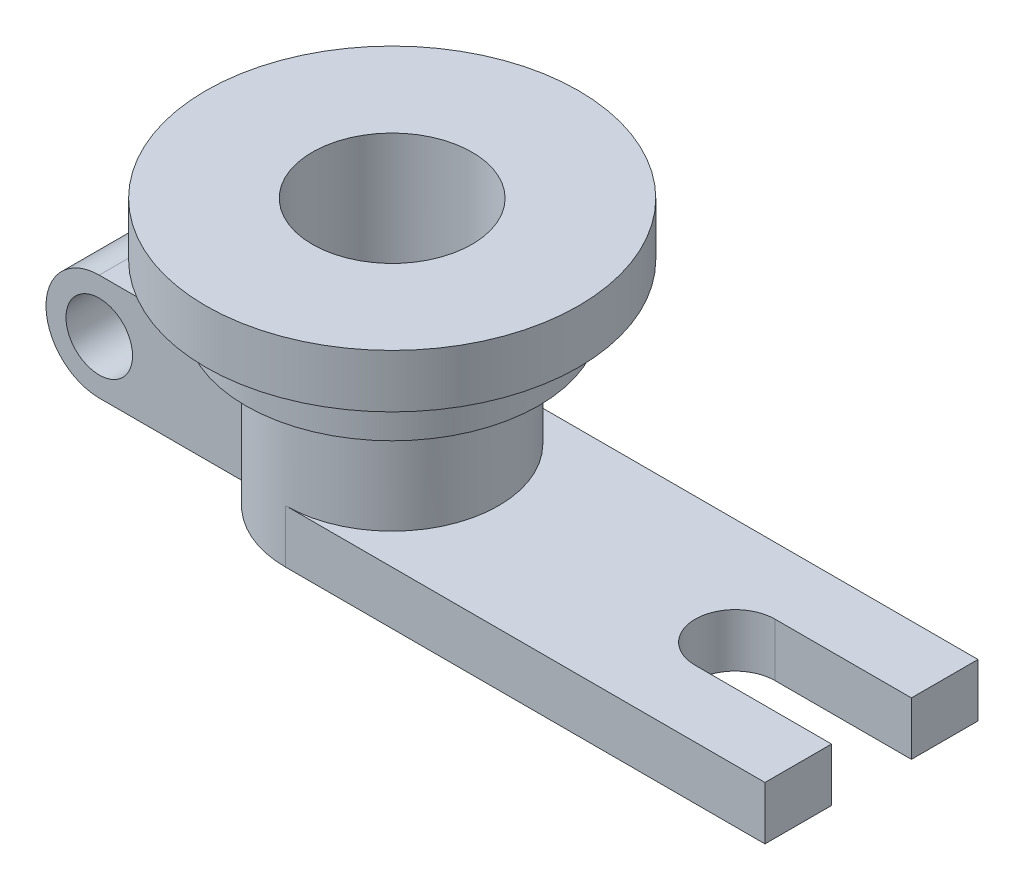
ISO-10303-21;
HEADER;
FILE_DESCRIPTION(('STEP AP214'),'2;1');
FILE_NAME('part.step','',(''),(''),'','','');
FILE_SCHEMA(('AUTOMOTIVE_DESIGN { 1 0 10303 214 1 1 1 1 }'));
ENDSEC;
DATA;
#1=APPLICATION_CONTEXT('core data for automotive mechanical design processes');
#2=APPLICATION_PROTOCOL_DEFINITION('international standard','automotive_design',2000,#1);
#3=PRODUCT_CONTEXT('',#1,'mechanical');
#4=PRODUCT('Part','Part','',(#3));
#5=PRODUCT_RELATED_PRODUCT_CATEGORY('part','',(#4));
#6=PRODUCT_DEFINITION_FORMATION('','',#4);
#7=PRODUCT_DEFINITION_CONTEXT('part definition',#1,'design');
#8=PRODUCT_DEFINITION('design','',#6,#7);
#9=PRODUCT_DEFINITION_SHAPE('','',#8);
#10=(LENGTH_UNIT() NAMED_UNIT(*) SI_UNIT(.MILLI.,.METRE.));
#11=(NAMED_UNIT(*) PLANE_ANGLE_UNIT() SI_UNIT($,.RADIAN.));
#12=(NAMED_UNIT(*) SI_UNIT($,.STERADIAN.) SOLID_ANGLE_UNIT());
#13=UNCERTAINTY_MEASURE_WITH_UNIT(LENGTH_MEASURE(1.E-05),#10,'distance_accuracy_value','');
#14=(GEOMETRIC_REPRESENTATION_CONTEXT(3) GLOBAL_UNCERTAINTY_ASSIGNED_CONTEXT((#13)) GLOBAL_UNIT_ASSIGNED_CONTEXT((#10,
#11,#12)) REPRESENTATION_CONTEXT('',''));
#15=CARTESIAN_POINT('',(0.,0.,0.));
#16=DIRECTION('',(0.,0.,1.));
#17=DIRECTION('',(1.,0.,0.));
#18=AXIS2_PLACEMENT_3D('',#15,#16,#17);
#19=CARTESIAN_POINT('',(180.001,-20.,20.));
#20=DIRECTION('',(0.,0.,-1.));
#21=DIRECTION('',(-1.,0.,0.));
#22=AXIS2_PLACEMENT_3D('',#19,#20,#21);
#23=PLANE('',#22);
#24=CARTESIAN_POINT('',(-90.,-40.,20.));
#25=DIRECTION('',(0.,0.,1.));
#26=DIRECTION('',(1.,0.,0.));
#27=AXIS2_PLACEMENT_3D('',#24,#25,#26);
#28=CIRCLE('',#27,12.5);
#29=CARTESIAN_POINT('',(-77.5,-40.,20.));
#30=VERTEX_POINT('',#29);
#31=EDGE_CURVE('E456',#30,#30,#28,.T.);
#32=ORIENTED_EDGE('',*,*,#31,.F.);
#33=EDGE_LOOP('',(#32));
#34=FACE_BOUND('',#33,.T.);
#35=DIRECTION('',(-1.,0.,0.));
#36=VECTOR('',#35,1.);
#37=CARTESIAN_POINT('',(180.001,-20.,20.));
#38=LINE('',#37,#36);
#39=CARTESIAN_POINT('',(-34.6410161513776,-20.,20.));
#40=VERTEX_POINT('',#39);
#41=CARTESIAN_POINT('',(-90.,-20.,20.));
#42=VERTEX_POINT('',#41);
#43=EDGE_CURVE('E138',#40,#42,#38,.T.);
#44=ORIENTED_EDGE('',*,*,#43,.T.);
#45=CARTESIAN_POINT('',(-90.,-40.,20.));
#46=DIRECTION('',(0.,0.,1.));
#47=DIRECTION('',(1.,0.,0.));
#48=AXIS2_PLACEMENT_3D('',#45,#46,#47);
#49=CIRCLE('',#48,20.);
#50=CARTESIAN_POINT('',(-90.,-60.,20.));
#51=VERTEX_POINT('',#50);
#52=EDGE_CURVE('E127',#42,#51,#49,.T.);
#53=ORIENTED_EDGE('',*,*,#52,.T.);
#54=DIRECTION('',(-1.,0.,0.));
#55=VECTOR('',#54,1.);
#56=CARTESIAN_POINT('',(180.001,-60.,20.));
#57=LINE('',#56,#55);
#58=CARTESIAN_POINT('',(-34.6410161513776,-60.,20.));
#59=VERTEX_POINT('',#58);
#60=EDGE_CURVE('E144',#59,#51,#57,.T.);
#61=ORIENTED_EDGE('',*,*,#60,.F.);
#62=DIRECTION('',(0.,1.,0.));
#63=VECTOR('',#62,1.);
#64=CARTESIAN_POINT('',(-34.6410161513776,-60.,20.));
#65=LINE('',#64,#63);
#66=EDGE_CURVE('E142',#40,#59,#65,.F.);
#67=ORIENTED_EDGE('',*,*,#66,.F.);
#68=EDGE_LOOP('',(#44,#53,#61,#67));
#69=FACE_BOUND('',#68,.T.);
#70=ADVANCED_FACE('F35',(#34,#69),#23,.F.);
#71=CARTESIAN_POINT('',(180.001,-20.,-20.));
#72=DIRECTION('',(0.,0.,1.));
#73=DIRECTION('',(0.,-1.,0.));
#74=AXIS2_PLACEMENT_3D('',#71,#72,#73);
#75=PLANE('',#74);
#76=CARTESIAN_POINT('',(-90.,-40.,-20.));
#77=DIRECTION('',(0.,0.,1.));
#78=DIRECTION('',(0.,-1.,0.));
#79=AXIS2_PLACEMENT_3D('',#76,#77,#78);
#80=CIRCLE('',#79,12.5);
#81=CARTESIAN_POINT('',(-90.,-52.5,-20.));
#82=VERTEX_POINT('',#81);
#83=EDGE_CURVE('E39',#82,#82,#80,.T.);
#84=ORIENTED_EDGE('',*,*,#83,.T.);
#85=EDGE_LOOP('',(#84));
#86=FACE_BOUND('',#85,.T.);
#87=CARTESIAN_POINT('',(-90.,-40.,-20.));
#88=DIRECTION('',(0.,0.,1.));
#89=DIRECTION('',(0.,-1.,0.));
#90=AXIS2_PLACEMENT_3D('',#87,#88,#89);
#91=CIRCLE('',#90,20.);
#92=CARTESIAN_POINT('',(-90.,-20.,-20.));
#93=VERTEX_POINT('',#92);
#94=CARTESIAN_POINT('',(-90.,-60.,-20.));
#95=VERTEX_POINT('',#94);
#96=EDGE_CURVE('E145',#93,#95,#91,.T.);
#97=ORIENTED_EDGE('',*,*,#96,.F.);
#98=DIRECTION('',(-1.,0.,0.));
#99=VECTOR('',#98,1.);
#100=CARTESIAN_POINT('',(180.001,-20.,-20.));
#101=LINE('',#100,#99);
#102=CARTESIAN_POINT('',(-34.6410161513775,-20.,-20.));
#103=VERTEX_POINT('',#102);
#104=EDGE_CURVE('E140',#103,#93,#101,.T.);
#105=ORIENTED_EDGE('',*,*,#104,.F.);
#106=DIRECTION('',(0.,1.,0.));
#107=VECTOR('',#106,1.);
#108=CARTESIAN_POINT('',(-34.6410161513775,-60.,-20.));
#109=LINE('',#108,#107);
#110=CARTESIAN_POINT('',(-34.6410161513775,-60.,-20.));
#111=VERTEX_POINT('',#110);
#112=EDGE_CURVE('E151',#111,#103,#109,.T.);
#113=ORIENTED_EDGE('',*,*,#112,.F.);
#114=DIRECTION('',(-1.,0.,0.));
#115=VECTOR('',#114,1.);
#116=CARTESIAN_POINT('',(180.001,-60.,-20.));
#117=LINE('',#116,#115);
#118=EDGE_CURVE('E51',#111,#95,#117,.T.);
#119=ORIENTED_EDGE('',*,*,#118,.T.);
#120=EDGE_LOOP('',(#97,#105,#113,#119));
#121=FACE_BOUND('',#120,.T.);
#122=ADVANCED_FACE('F256',(#86,#121),#75,.F.);
#123=CARTESIAN_POINT('',(0.,-60.,0.));
#124=DIRECTION('',(0.,1.,0.));
#125=DIRECTION('',(0.,0.,1.));
#126=AXIS2_PLACEMENT_3D('',#123,#124,#125);
#127=CYLINDRICAL_SURFACE('',#126,40.);
#128=CARTESIAN_POINT('',(0.,0.,0.));
#129=DIRECTION('',(0.,1.,0.));
#130=DIRECTION('',(0.,0.,1.));
#131=AXIS2_PLACEMENT_3D('',#128,#129,#130);
#132=CIRCLE('',#131,40.);
#133=CARTESIAN_POINT('',(0.,0.,40.));
#134=VERTEX_POINT('',#133);
#135=EDGE_CURVE('E44',#134,#134,#132,.F.);
#136=ORIENTED_EDGE('',*,*,#135,.T.);
#137=EDGE_LOOP('',(#136));
#138=FACE_BOUND('',#137,.T.);
#139=ORIENTED_EDGE('',*,*,#66,.T.);
#140=CARTESIAN_POINT('',(0.,-60.,0.));
#141=DIRECTION('',(0.,-1.,0.));
#142=DIRECTION('',(0.,0.,-1.));
#143=AXIS2_PLACEMENT_3D('',#140,#141,#142);
#144=CIRCLE('',#143,40.);
#145=CARTESIAN_POINT('',(0.,-60.,40.));
#146=VERTEX_POINT('',#145);
#147=EDGE_CURVE('E218',#146,#59,#144,.T.);
#148=ORIENTED_EDGE('',*,*,#147,.F.);
#149=DIRECTION('',(0.,1.,0.));
#150=VECTOR('',#149,1.);
#151=CARTESIAN_POINT('',(0.,-60.,40.));
#152=LINE('',#151,#150);
#153=CARTESIAN_POINT('',(0.,-40.,40.));
#154=VERTEX_POINT('',#153);
#155=EDGE_CURVE('E180',#154,#146,#152,.F.);
#156=ORIENTED_EDGE('',*,*,#155,.F.);
#157=CARTESIAN_POINT('',(0.,-40.,0.));
#158=DIRECTION('',(0.,1.,0.));
#159=DIRECTION('',(0.,0.,1.));
#160=AXIS2_PLACEMENT_3D('',#157,#158,#159);
#161=CIRCLE('',#160,40.);
#162=CARTESIAN_POINT('',(0.,-40.,-40.));
#163=VERTEX_POINT('',#162);
#164=EDGE_CURVE('E183',#163,#154,#161,.F.);
#165=ORIENTED_EDGE('',*,*,#164,.F.);
#166=DIRECTION('',(0.,1.,0.));
#167=VECTOR('',#166,1.);
#168=CARTESIAN_POINT('',(0.,-60.,-40.));
#169=LINE('',#168,#167);
#170=CARTESIAN_POINT('',(0.,-60.,-40.));
#171=VERTEX_POINT('',#170);
#172=EDGE_CURVE('E182',#163,#171,#169,.F.);
#173=ORIENTED_EDGE('',*,*,#172,.T.);
#174=EDGE_CURVE('E215',#111,#171,#144,.T.);
#175=ORIENTED_EDGE('',*,*,#174,.F.);
#176=ORIENTED_EDGE('',*,*,#112,.T.);
#177=CARTESIAN_POINT('',(0.,-20.,0.));
#178=DIRECTION('',(0.,-1.,0.));
#179=DIRECTION('',(0.,0.,-1.));
#180=AXIS2_PLACEMENT_3D('',#177,#178,#179);
#181=CIRCLE('',#180,40.);
#182=EDGE_CURVE('E155',#103,#40,#181,.F.);
#183=ORIENTED_EDGE('',*,*,#182,.T.);
#184=EDGE_LOOP('',(#139,#148,#156,#165,#173,#175,#176,#183));
#185=FACE_BOUND('',#184,.T.);
#186=ADVANCED_FACE('F236',(#138,#185),#127,.T.);
#187=CARTESIAN_POINT('',(180.,0.,0.));
#188=DIRECTION('',(1.,0.,0.));
#189=DIRECTION('',(0.,0.,-1.));
#190=AXIS2_PLACEMENT_3D('',#187,#188,#189);
#191=PLANE('',#190);
#192=DIRECTION('',(0.,1.,0.));
#193=VECTOR('',#192,1.);
#194=CARTESIAN_POINT('',(180.,-100.,-15.0000000000001));
#195=LINE('',#194,#193);
#196=CARTESIAN_POINT('',(180.,-60.,-15.0000000000001));
#197=VERTEX_POINT('',#196);
#198=CARTESIAN_POINT('',(180.,-40.,-15.));
#199=VERTEX_POINT('',#198);
#200=EDGE_CURVE('E168',#197,#199,#195,.T.);
#201=ORIENTED_EDGE('',*,*,#200,.F.);
#202=DIRECTION('',(0.,0.,-1.));
#203=VECTOR('',#202,1.);
#204=CARTESIAN_POINT('',(180.,-60.,40.));
#205=LINE('',#204,#203);
#206=CARTESIAN_POINT('',(180.,-60.,-40.));
#207=VERTEX_POINT('',#206);
#208=EDGE_CURVE('E196',#197,#207,#205,.T.);
#209=ORIENTED_EDGE('',*,*,#208,.T.);
#210=DIRECTION('',(0.,1.,0.));
#211=VECTOR('',#210,1.);
#212=CARTESIAN_POINT('',(180.,-40.,-40.));
#213=LINE('',#212,#211);
#214=CARTESIAN_POINT('',(180.,-40.,-40.));
#215=VERTEX_POINT('',#214);
#216=EDGE_CURVE('E179',#207,#215,#213,.T.);
#217=ORIENTED_EDGE('',*,*,#216,.T.);
#218=DIRECTION('',(0.,0.,1.));
#219=VECTOR('',#218,1.);
#220=CARTESIAN_POINT('',(180.,-40.,40.));
#221=LINE('',#220,#219);
#222=EDGE_CURVE('E190',#215,#199,#221,.T.);
#223=ORIENTED_EDGE('',*,*,#222,.T.);
#224=EDGE_LOOP('',(#201,#209,#217,#223));
#225=FACE_BOUND('',#224,.T.);
#226=ADVANCED_FACE('F246',(#225),#191,.T.);
#227=CARTESIAN_POINT('',(0.,20.,0.));
#228=DIRECTION('',(0.,-1.,0.));
#229=DIRECTION('',(0.,0.,-1.));
#230=AXIS2_PLACEMENT_3D('',#227,#228,#229);
#231=CYLINDRICAL_SURFACE('',#230,55.);
#232=CARTESIAN_POINT('',(0.,20.,0.));
#233=DIRECTION('',(0.,1.,0.));
#234=DIRECTION('',(0.,0.,1.));
#235=AXIS2_PLACEMENT_3D('',#232,#233,#234);
#236=CIRCLE('',#235,55.);
#237=CARTESIAN_POINT('',(0.,20.,55.));
#238=VERTEX_POINT('',#237);
#239=EDGE_CURVE('E228',#238,#238,#236,.T.);
#240=ORIENTED_EDGE('',*,*,#239,.F.);
#241=EDGE_LOOP('',(#240));
#242=FACE_BOUND('',#241,.T.);
#243=CARTESIAN_POINT('',(0.,0.,0.));
#244=DIRECTION('',(0.,1.,0.));
#245=DIRECTION('',(0.,0.,1.));
#246=AXIS2_PLACEMENT_3D('',#243,#244,#245);
#247=CIRCLE('',#246,55.);
#248=CARTESIAN_POINT('',(0.,0.,55.));
#249=VERTEX_POINT('',#248);
#250=EDGE_CURVE('E225',#249,#249,#247,.T.);
#251=ORIENTED_EDGE('',*,*,#250,.T.);
#252=EDGE_LOOP('',(#251));
#253=FACE_BOUND('',#252,.T.);
#254=ADVANCED_FACE('F37',(#242,#253),#231,.T.);
#255=CARTESIAN_POINT('',(0.,0.,0.));
#256=DIRECTION('',(0.,1.,0.));
#257=DIRECTION('',(0.,0.,1.));
#258=AXIS2_PLACEMENT_3D('',#255,#256,#257);
#259=PLANE('',#258);
#260=ORIENTED_EDGE('',*,*,#135,.F.);
#261=EDGE_LOOP('',(#260));
#262=FACE_BOUND('',#261,.T.);
#263=ORIENTED_EDGE('',*,*,#250,.F.);
#264=EDGE_LOOP('',(#263));
#265=FACE_BOUND('',#264,.T.);
#266=ADVANCED_FACE('F239',(#262,#265),#259,.F.);
#267=CARTESIAN_POINT('',(0.,40.,0.));
#268=DIRECTION('',(0.,-1.,0.));
#269=DIRECTION('',(0.,0.,-1.));
#270=AXIS2_PLACEMENT_3D('',#267,#268,#269);
#271=CYLINDRICAL_SURFACE('',#270,70.);
#272=CARTESIAN_POINT('',(0.,40.,0.));
#273=DIRECTION('',(0.,1.,0.));
#274=DIRECTION('',(0.,0.,1.));
#275=AXIS2_PLACEMENT_3D('',#272,#273,#274);
#276=CIRCLE('',#275,70.);
#277=CARTESIAN_POINT('',(0.,40.,70.));
#278=VERTEX_POINT('',#277);
#279=EDGE_CURVE('E222',#278,#278,#276,.T.);
#280=ORIENTED_EDGE('',*,*,#279,.F.);
#281=EDGE_LOOP('',(#280));
#282=FACE_BOUND('',#281,.T.);
#283=CARTESIAN_POINT('',(0.,20.,0.));
#284=DIRECTION('',(0.,1.,0.));
#285=DIRECTION('',(0.,0.,1.));
#286=AXIS2_PLACEMENT_3D('',#283,#284,#285);
#287=CIRCLE('',#286,70.);
#288=CARTESIAN_POINT('',(0.,20.,70.));
#289=VERTEX_POINT('',#288);
#290=EDGE_CURVE('E221',#289,#289,#287,.T.);
#291=ORIENTED_EDGE('',*,*,#290,.T.);
#292=EDGE_LOOP('',(#291));
#293=FACE_BOUND('',#292,.T.);
#294=ADVANCED_FACE('F242',(#282,#293),#271,.T.);
#295=CARTESIAN_POINT('',(0.,40.,0.));
#296=DIRECTION('',(0.,1.,0.));
#297=DIRECTION('',(0.,0.,1.));
#298=AXIS2_PLACEMENT_3D('',#295,#296,#297);
#299=PLANE('',#298);
#300=CARTESIAN_POINT('',(0.,40.,0.));
#301=DIRECTION('',(0.,1.,0.));
#302=DIRECTION('',(0.,0.,1.));
#303=AXIS2_PLACEMENT_3D('',#300,#301,#302);
#304=CIRCLE('',#303,30.);
#305=CARTESIAN_POINT('',(0.,40.,30.));
#306=VERTEX_POINT('',#305);
#307=EDGE_CURVE('E212',#306,#306,#304,.T.);
#308=ORIENTED_EDGE('',*,*,#307,.F.);
#309=EDGE_LOOP('',(#308));
#310=FACE_BOUND('',#309,.T.);
#311=ORIENTED_EDGE('',*,*,#279,.T.);
#312=EDGE_LOOP('',(#311));
#313=FACE_BOUND('',#312,.T.);
#314=ADVANCED_FACE('F302',(#310,#313),#299,.T.);
#315=CARTESIAN_POINT('',(0.,20.,0.));
#316=DIRECTION('',(0.,1.,0.));
#317=DIRECTION('',(0.,0.,1.));
#318=AXIS2_PLACEMENT_3D('',#315,#316,#317);
#319=PLANE('',#318);
#320=ORIENTED_EDGE('',*,*,#239,.T.);
#321=EDGE_LOOP('',(#320));
#322=FACE_BOUND('',#321,.T.);
#323=ORIENTED_EDGE('',*,*,#290,.F.);
#324=EDGE_LOOP('',(#323));
#325=FACE_BOUND('',#324,.T.);
#326=ADVANCED_FACE('F299',(#322,#325),#319,.F.);
#327=CARTESIAN_POINT('',(0.,-60.,0.));
#328=DIRECTION('',(0.,-1.,0.));
#329=DIRECTION('',(0.,0.,-1.));
#330=AXIS2_PLACEMENT_3D('',#327,#328,#329);
#331=PLANE('',#330);
#332=DIRECTION('',(0.,0.,1.));
#333=VECTOR('',#332,1.);
#334=CARTESIAN_POINT('',(-90.,-60.,-40.));
#335=LINE('',#334,#333);
#336=EDGE_CURVE('E130',#95,#51,#335,.T.);
#337=ORIENTED_EDGE('',*,*,#336,.F.);
#338=ORIENTED_EDGE('',*,*,#118,.F.);
#339=ORIENTED_EDGE('',*,*,#174,.T.);
#340=DIRECTION('',(1.,0.,0.));
#341=VECTOR('',#340,1.);
#342=CARTESIAN_POINT('',(-70.001,-60.,-40.));
#343=LINE('',#342,#341);
#344=EDGE_CURVE('E201',#171,#207,#343,.T.);
#345=ORIENTED_EDGE('',*,*,#344,.T.);
#346=ORIENTED_EDGE('',*,*,#208,.F.);
#347=DIRECTION('',(1.,0.,0.));
#348=VECTOR('',#347,1.);
#349=CARTESIAN_POINT('',(0.,-60.,-15.0000000000001));
#350=LINE('',#349,#348);
#351=CARTESIAN_POINT('',(128.77352259968,-60.,-15.0000000000001));
#352=VERTEX_POINT('',#351);
#353=EDGE_CURVE('E175',#352,#197,#350,.T.);
#354=ORIENTED_EDGE('',*,*,#353,.F.);
#355=CARTESIAN_POINT('',(128.77352259968,-60.,0.));
#356=DIRECTION('',(0.,-1.,0.));
#357=DIRECTION('',(0.,0.,-1.));
#358=AXIS2_PLACEMENT_3D('',#355,#356,#357);
#359=CIRCLE('',#358,15.);
#360=CARTESIAN_POINT('',(128.77352259968,-60.,15.));
#361=VERTEX_POINT('',#360);
#362=EDGE_CURVE('E177',#361,#352,#359,.T.);
#363=ORIENTED_EDGE('',*,*,#362,.F.);
#364=DIRECTION('',(-1.,0.,0.));
#365=VECTOR('',#364,1.);
#366=CARTESIAN_POINT('',(0.,-60.,15.));
#367=LINE('',#366,#365);
#368=CARTESIAN_POINT('',(180.,-60.,15.));
#369=VERTEX_POINT('',#368);
#370=EDGE_CURVE('E167',#369,#361,#367,.T.);
#371=ORIENTED_EDGE('',*,*,#370,.F.);
#372=CARTESIAN_POINT('',(180.,-60.,40.));
#373=VERTEX_POINT('',#372);
#374=EDGE_CURVE('E197',#373,#369,#205,.T.);
#375=ORIENTED_EDGE('',*,*,#374,.F.);
#376=DIRECTION('',(1.,0.,0.));
#377=VECTOR('',#376,1.);
#378=CARTESIAN_POINT('',(-70.001,-60.,40.));
#379=LINE('',#378,#377);
#380=EDGE_CURVE('E204',#146,#373,#379,.T.);
#381=ORIENTED_EDGE('',*,*,#380,.F.);
#382=ORIENTED_EDGE('',*,*,#147,.T.);
#383=ORIENTED_EDGE('',*,*,#60,.T.);
#384=EDGE_LOOP('',(#337,#338,#339,#345,#346,#354,#363,#371,#375,#381,#382,#383));
#385=FACE_BOUND('',#384,.T.);
#386=CARTESIAN_POINT('',(0.,-60.,0.));
#387=DIRECTION('',(0.,-1.,0.));
#388=DIRECTION('',(0.,0.,-1.));
#389=AXIS2_PLACEMENT_3D('',#386,#387,#388);
#390=CIRCLE('',#389,30.);
#391=CARTESIAN_POINT('',(0.,-60.,-30.));
#392=VERTEX_POINT('',#391);
#393=EDGE_CURVE('E186',#392,#392,#390,.F.);
#394=ORIENTED_EDGE('',*,*,#393,.T.);
#395=EDGE_LOOP('',(#394));
#396=FACE_BOUND('',#395,.T.);
#397=ADVANCED_FACE('F295',(#385,#396),#331,.T.);
#398=CARTESIAN_POINT('',(0.,-60.001,0.));
#399=DIRECTION('',(0.,1.,0.));
#400=DIRECTION('',(0.,0.,1.));
#401=AXIS2_PLACEMENT_3D('',#398,#399,#400);
#402=CYLINDRICAL_SURFACE('',#401,30.);
#403=ORIENTED_EDGE('',*,*,#393,.F.);
#404=EDGE_LOOP('',(#403));
#405=FACE_BOUND('',#404,.T.);
#406=ORIENTED_EDGE('',*,*,#307,.T.);
#407=EDGE_LOOP('',(#406));
#408=FACE_BOUND('',#407,.T.);
#409=ADVANCED_FACE('F281',(#405,#408),#402,.F.);
#410=DIRECTION('',(0.,1.,0.));
#411=VECTOR('',#410,1.);
#412=CARTESIAN_POINT('',(180.,-100.,15.));
#413=LINE('',#412,#411);
#414=CARTESIAN_POINT('',(180.,-40.,15.));
#415=VERTEX_POINT('',#414);
#416=EDGE_CURVE('E170',#369,#415,#413,.T.);
#417=ORIENTED_EDGE('',*,*,#416,.T.);
#418=CARTESIAN_POINT('',(180.,-40.,40.));
#419=VERTEX_POINT('',#418);
#420=EDGE_CURVE('E189',#415,#419,#221,.T.);
#421=ORIENTED_EDGE('',*,*,#420,.T.);
#422=DIRECTION('',(0.,-1.,0.));
#423=VECTOR('',#422,1.);
#424=CARTESIAN_POINT('',(180.,-40.,40.));
#425=LINE('',#424,#423);
#426=EDGE_CURVE('E193',#419,#373,#425,.T.);
#427=ORIENTED_EDGE('',*,*,#426,.T.);
#428=ORIENTED_EDGE('',*,*,#374,.T.);
#429=EDGE_LOOP('',(#417,#421,#427,#428));
#430=FACE_BOUND('',#429,.T.);
#431=ADVANCED_FACE('F253',(#430),#191,.T.);
#432=CARTESIAN_POINT('',(-70.001,-40.,40.));
#433=DIRECTION('',(0.,1.,0.));
#434=DIRECTION('',(0.,0.,1.));
#435=AXIS2_PLACEMENT_3D('',#432,#433,#434);
#436=PLANE('',#435);
#437=DIRECTION('',(-1.,0.,0.));
#438=VECTOR('',#437,1.);
#439=CARTESIAN_POINT('',(128.77352259968,-40.,-15.));
#440=LINE('',#439,#438);
#441=CARTESIAN_POINT('',(128.77352259968,-40.,-15.));
#442=VERTEX_POINT('',#441);
#443=EDGE_CURVE('E161',#199,#442,#440,.T.);
#444=ORIENTED_EDGE('',*,*,#443,.F.);
#445=ORIENTED_EDGE('',*,*,#222,.F.);
#446=DIRECTION('',(1.,0.,0.));
#447=VECTOR('',#446,1.);
#448=CARTESIAN_POINT('',(-70.001,-40.,-40.));
#449=LINE('',#448,#447);
#450=EDGE_CURVE('E200',#163,#215,#449,.T.);
#451=ORIENTED_EDGE('',*,*,#450,.F.);
#452=ORIENTED_EDGE('',*,*,#164,.T.);
#453=DIRECTION('',(1.,0.,0.));
#454=VECTOR('',#453,1.);
#455=CARTESIAN_POINT('',(-70.001,-40.,40.));
#456=LINE('',#455,#454);
#457=EDGE_CURVE('E206',#154,#419,#456,.T.);
#458=ORIENTED_EDGE('',*,*,#457,.T.);
#459=ORIENTED_EDGE('',*,*,#420,.F.);
#460=DIRECTION('',(1.,0.,0.));
#461=VECTOR('',#460,1.);
#462=CARTESIAN_POINT('',(128.77352259968,-40.,15.));
#463=LINE('',#462,#461);
#464=CARTESIAN_POINT('',(128.77352259968,-40.,15.));
#465=VERTEX_POINT('',#464);
#466=EDGE_CURVE('E159',#465,#415,#463,.T.);
#467=ORIENTED_EDGE('',*,*,#466,.F.);
#468=CARTESIAN_POINT('',(128.77352259968,-40.,0.));
#469=DIRECTION('',(0.,1.,0.));
#470=DIRECTION('',(0.,0.,1.));
#471=AXIS2_PLACEMENT_3D('',#468,#469,#470);
#472=CIRCLE('',#471,15.);
#473=EDGE_CURVE('E59',#442,#465,#472,.T.);
#474=ORIENTED_EDGE('',*,*,#473,.F.);
#475=EDGE_LOOP('',(#444,#445,#451,#452,#458,#459,#467,#474));
#476=FACE_BOUND('',#475,.T.);
#477=ADVANCED_FACE('F280',(#476),#436,.T.);
#478=CARTESIAN_POINT('',(-70.001,-40.,40.));
#479=DIRECTION('',(0.,0.,1.));
#480=DIRECTION('',(0.,-1.,0.));
#481=AXIS2_PLACEMENT_3D('',#478,#479,#480);
#482=PLANE('',#481);
#483=ORIENTED_EDGE('',*,*,#457,.F.);
#484=ORIENTED_EDGE('',*,*,#155,.T.);
#485=ORIENTED_EDGE('',*,*,#380,.T.);
#486=ORIENTED_EDGE('',*,*,#426,.F.);
#487=EDGE_LOOP('',(#483,#484,#485,#486));
#488=FACE_BOUND('',#487,.T.);
#489=ADVANCED_FACE('F283',(#488),#482,.T.);
#490=CARTESIAN_POINT('',(-70.001,-40.,-40.));
#491=DIRECTION('',(0.,0.,-1.));
#492=DIRECTION('',(-1.,0.,0.));
#493=AXIS2_PLACEMENT_3D('',#490,#491,#492);
#494=PLANE('',#493);
#495=ORIENTED_EDGE('',*,*,#172,.F.);
#496=ORIENTED_EDGE('',*,*,#450,.T.);
#497=ORIENTED_EDGE('',*,*,#216,.F.);
#498=ORIENTED_EDGE('',*,*,#344,.F.);
#499=EDGE_LOOP('',(#495,#496,#497,#498));
#500=FACE_BOUND('',#499,.T.);
#501=ADVANCED_FACE('F277',(#500),#494,.T.);
#502=CARTESIAN_POINT('',(128.77352259968,-100.,0.));
#503=DIRECTION('',(0.,1.,0.));
#504=DIRECTION('',(0.,0.,1.));
#505=AXIS2_PLACEMENT_3D('',#502,#503,#504);
#506=CYLINDRICAL_SURFACE('',#505,15.);
#507=ORIENTED_EDGE('',*,*,#362,.T.);
#508=DIRECTION('',(0.,1.,0.));
#509=VECTOR('',#508,1.);
#510=CARTESIAN_POINT('',(128.77352259968,-100.,-15.0000000000001));
#511=LINE('',#510,#509);
#512=EDGE_CURVE('E165',#352,#442,#511,.T.);
#513=ORIENTED_EDGE('',*,*,#512,.T.);
#514=ORIENTED_EDGE('',*,*,#473,.T.);
#515=DIRECTION('',(0.,1.,0.));
#516=VECTOR('',#515,1.);
#517=CARTESIAN_POINT('',(128.77352259968,-100.,15.));
#518=LINE('',#517,#516);
#519=EDGE_CURVE('E164',#361,#465,#518,.T.);
#520=ORIENTED_EDGE('',*,*,#519,.F.);
#521=EDGE_LOOP('',(#507,#513,#514,#520));
#522=FACE_BOUND('',#521,.T.);
#523=ADVANCED_FACE('F271',(#522),#506,.F.);
#524=CARTESIAN_POINT('',(128.77352259968,-100.,-15.0000000000001));
#525=DIRECTION('',(0.,0.,-1.));
#526=DIRECTION('',(0.,1.,0.));
#527=AXIS2_PLACEMENT_3D('',#524,#525,#526);
#528=PLANE('',#527);
#529=ORIENTED_EDGE('',*,*,#353,.T.);
#530=ORIENTED_EDGE('',*,*,#200,.T.);
#531=ORIENTED_EDGE('',*,*,#443,.T.);
#532=ORIENTED_EDGE('',*,*,#512,.F.);
#533=EDGE_LOOP('',(#529,#530,#531,#532));
#534=FACE_BOUND('',#533,.T.);
#535=ADVANCED_FACE('F267',(#534),#528,.F.);
#536=CARTESIAN_POINT('',(128.77352259968,-100.,15.));
#537=DIRECTION('',(0.,0.,1.));
#538=DIRECTION('',(0.,-1.,0.));
#539=AXIS2_PLACEMENT_3D('',#536,#537,#538);
#540=PLANE('',#539);
#541=ORIENTED_EDGE('',*,*,#370,.T.);
#542=ORIENTED_EDGE('',*,*,#519,.T.);
#543=ORIENTED_EDGE('',*,*,#466,.T.);
#544=ORIENTED_EDGE('',*,*,#416,.F.);
#545=EDGE_LOOP('',(#541,#542,#543,#544));
#546=FACE_BOUND('',#545,.T.);
#547=ADVANCED_FACE('F270',(#546),#540,.F.);
#548=CARTESIAN_POINT('',(180.001,-20.,-20.));
#549=DIRECTION('',(0.,-1.,0.));
#550=DIRECTION('',(0.,0.,-1.));
#551=AXIS2_PLACEMENT_3D('',#548,#549,#550);
#552=PLANE('',#551);
#553=ORIENTED_EDGE('',*,*,#104,.T.);
#554=DIRECTION('',(0.,0.,1.));
#555=VECTOR('',#554,1.);
#556=CARTESIAN_POINT('',(-90.,-20.,-40.));
#557=LINE('',#556,#555);
#558=EDGE_CURVE('E11',#93,#42,#557,.T.);
#559=ORIENTED_EDGE('',*,*,#558,.T.);
#560=ORIENTED_EDGE('',*,*,#43,.F.);
#561=ORIENTED_EDGE('',*,*,#182,.F.);
#562=EDGE_LOOP('',(#553,#559,#560,#561));
#563=FACE_BOUND('',#562,.T.);
#564=ADVANCED_FACE('F136',(#563),#552,.F.);
#565=CARTESIAN_POINT('',(-90.,-40.,-40.));
#566=DIRECTION('',(0.,0.,1.));
#567=DIRECTION('',(1.,0.,0.));
#568=AXIS2_PLACEMENT_3D('',#565,#566,#567);
#569=CYLINDRICAL_SURFACE('',#568,20.);
#570=ORIENTED_EDGE('',*,*,#96,.T.);
#571=ORIENTED_EDGE('',*,*,#336,.T.);
#572=ORIENTED_EDGE('',*,*,#52,.F.);
#573=ORIENTED_EDGE('',*,*,#558,.F.);
#574=EDGE_LOOP('',(#570,#571,#572,#573));
#575=FACE_BOUND('',#574,.T.);
#576=ADVANCED_FACE('F128',(#575),#569,.T.);
#577=CARTESIAN_POINT('',(-90.,-40.,-40.));
#578=DIRECTION('',(0.,0.,1.));
#579=DIRECTION('',(1.,0.,0.));
#580=AXIS2_PLACEMENT_3D('',#577,#578,#579);
#581=CYLINDRICAL_SURFACE('',#580,12.5);
#582=ORIENTED_EDGE('',*,*,#31,.T.);
#583=EDGE_LOOP('',(#582));
#584=FACE_BOUND('',#583,.T.);
#585=ORIENTED_EDGE('',*,*,#83,.F.);
#586=EDGE_LOOP('',(#585));
#587=FACE_BOUND('',#586,.T.);
#588=ADVANCED_FACE('F377',(#584,#587),#581,.F.);
#589=CLOSED_SHELL('',(#70,#122,#186,#226,#254,#266,#294,#314,#326,#397,#409,#431,#477,#489,#501,
#523,#535,#547,#564,#576,#588));
#590=MANIFOLD_SOLID_BREP('B2',#589);
#591=ADVANCED_BREP_SHAPE_REPRESENTATION('',(#18,#590),#14);
#592=SHAPE_DEFINITION_REPRESENTATION(#9,#591);
ENDSEC;
END-ISO-10303-21;
